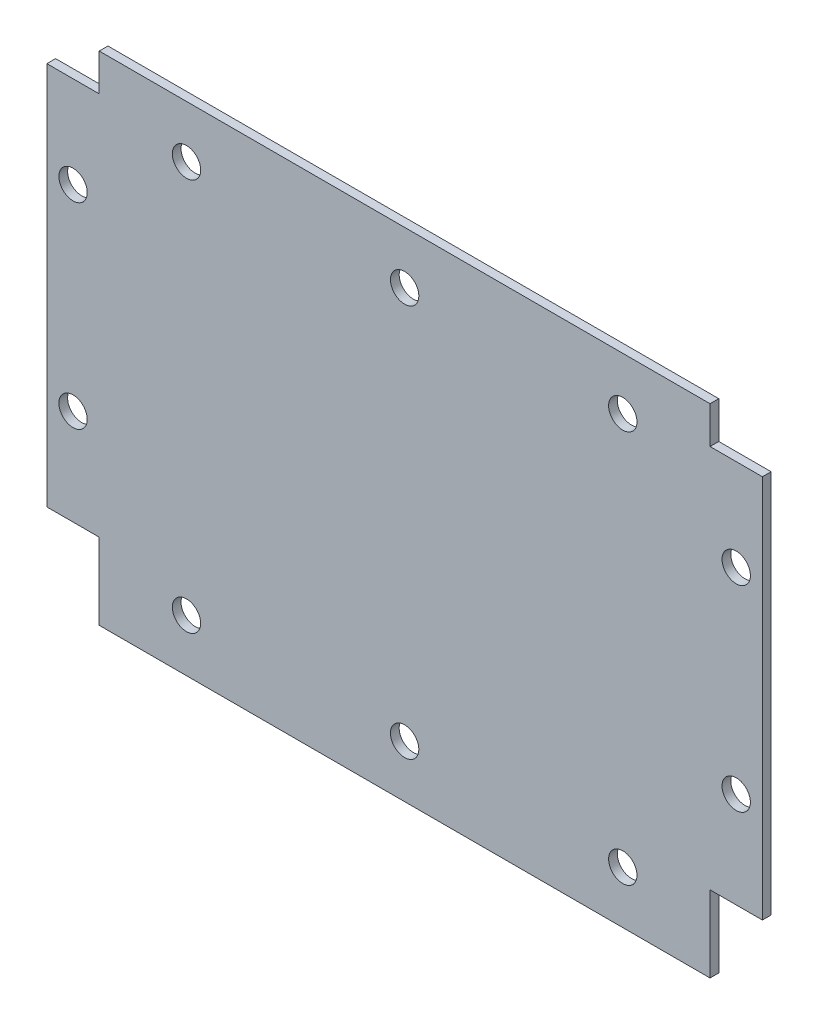
ISO-10303-21;
HEADER;
FILE_DESCRIPTION(('STEP AP214'),'2;1');
FILE_NAME('part.step','',(''),(''),'','','');
FILE_SCHEMA(('AUTOMOTIVE_DESIGN { 1 0 10303 214 1 1 1 1 }'));
ENDSEC;
DATA;
#1=APPLICATION_CONTEXT('core data for automotive mechanical design processes');
#2=APPLICATION_PROTOCOL_DEFINITION('international standard','automotive_design',2000,#1);
#3=PRODUCT_CONTEXT('',#1,'mechanical');
#4=PRODUCT('Part','Part','',(#3));
#5=PRODUCT_RELATED_PRODUCT_CATEGORY('part','',(#4));
#6=PRODUCT_DEFINITION_FORMATION('','',#4);
#7=PRODUCT_DEFINITION_CONTEXT('part definition',#1,'design');
#8=PRODUCT_DEFINITION('design','',#6,#7);
#9=PRODUCT_DEFINITION_SHAPE('','',#8);
#10=(LENGTH_UNIT() NAMED_UNIT(*) SI_UNIT(.MILLI.,.METRE.));
#11=(NAMED_UNIT(*) PLANE_ANGLE_UNIT() SI_UNIT($,.RADIAN.));
#12=(NAMED_UNIT(*) SI_UNIT($,.STERADIAN.) SOLID_ANGLE_UNIT());
#13=UNCERTAINTY_MEASURE_WITH_UNIT(LENGTH_MEASURE(1.E-05),#10,'distance_accuracy_value','');
#14=(GEOMETRIC_REPRESENTATION_CONTEXT(3) GLOBAL_UNCERTAINTY_ASSIGNED_CONTEXT((#13)) GLOBAL_UNIT_ASSIGNED_CONTEXT((#10,
#11,#12)) REPRESENTATION_CONTEXT('',''));
#15=CARTESIAN_POINT('',(0.,0.,0.));
#16=DIRECTION('',(0.,0.,1.));
#17=DIRECTION('',(1.,0.,0.));
#18=AXIS2_PLACEMENT_3D('',#15,#16,#17);
#19=CARTESIAN_POINT('',(70.,57.,2.));
#20=DIRECTION('',(0.,0.,-1.));
#21=DIRECTION('',(-1.,0.,0.));
#22=AXIS2_PLACEMENT_3D('',#19,#20,#21);
#23=PLANE('',#22);
#24=CARTESIAN_POINT('',(-76.,27.5,2.));
#25=DIRECTION('',(0.,0.,1.));
#26=DIRECTION('',(1.,0.,0.));
#27=AXIS2_PLACEMENT_3D('',#24,#25,#26);
#28=CIRCLE('',#27,3.24999999999999);
#29=CARTESIAN_POINT('',(-72.75,27.5,2.));
#30=VERTEX_POINT('',#29);
#31=EDGE_CURVE('E308',#30,#30,#28,.T.);
#32=ORIENTED_EDGE('',*,*,#31,.F.);
#33=EDGE_LOOP('',(#32));
#34=FACE_BOUND('',#33,.T.);
#35=CARTESIAN_POINT('',(-76.,-17.5,2.));
#36=DIRECTION('',(0.,0.,1.));
#37=DIRECTION('',(1.,0.,0.));
#38=AXIS2_PLACEMENT_3D('',#35,#36,#37);
#39=CIRCLE('',#38,3.24999999999999);
#40=CARTESIAN_POINT('',(-72.75,-17.5,2.));
#41=VERTEX_POINT('',#40);
#42=EDGE_CURVE('E310',#41,#41,#39,.T.);
#43=ORIENTED_EDGE('',*,*,#42,.F.);
#44=EDGE_LOOP('',(#43));
#45=FACE_BOUND('',#44,.T.);
#46=CARTESIAN_POINT('',(-50.,-45.,2.));
#47=DIRECTION('',(0.,0.,1.));
#48=DIRECTION('',(1.,0.,0.));
#49=AXIS2_PLACEMENT_3D('',#46,#47,#48);
#50=CIRCLE('',#49,3.24999999999999);
#51=CARTESIAN_POINT('',(-46.75,-45.,2.));
#52=VERTEX_POINT('',#51);
#53=EDGE_CURVE('E318',#52,#52,#50,.T.);
#54=ORIENTED_EDGE('',*,*,#53,.F.);
#55=EDGE_LOOP('',(#54));
#56=FACE_BOUND('',#55,.T.);
#57=CARTESIAN_POINT('',(0.,-45.,2.));
#58=DIRECTION('',(0.,0.,1.));
#59=DIRECTION('',(1.,0.,0.));
#60=AXIS2_PLACEMENT_3D('',#57,#58,#59);
#61=CIRCLE('',#60,3.24999999999999);
#62=CARTESIAN_POINT('',(3.24999999999999,-45.,2.));
#63=VERTEX_POINT('',#62);
#64=EDGE_CURVE('E324',#63,#63,#61,.T.);
#65=ORIENTED_EDGE('',*,*,#64,.F.);
#66=EDGE_LOOP('',(#65));
#67=FACE_BOUND('',#66,.T.);
#68=CARTESIAN_POINT('',(50.,-45.,2.));
#69=DIRECTION('',(0.,0.,1.));
#70=DIRECTION('',(1.,0.,0.));
#71=AXIS2_PLACEMENT_3D('',#68,#69,#70);
#72=CIRCLE('',#71,3.24999999999999);
#73=CARTESIAN_POINT('',(53.25,-45.,2.));
#74=VERTEX_POINT('',#73);
#75=EDGE_CURVE('E330',#74,#74,#72,.T.);
#76=ORIENTED_EDGE('',*,*,#75,.F.);
#77=EDGE_LOOP('',(#76));
#78=FACE_BOUND('',#77,.T.);
#79=CARTESIAN_POINT('',(50.,45.,2.));
#80=DIRECTION('',(0.,0.,1.));
#81=DIRECTION('',(1.,0.,0.));
#82=AXIS2_PLACEMENT_3D('',#79,#80,#81);
#83=CIRCLE('',#82,3.24999999999999);
#84=CARTESIAN_POINT('',(53.25,45.,2.));
#85=VERTEX_POINT('',#84);
#86=EDGE_CURVE('E336',#85,#85,#83,.T.);
#87=ORIENTED_EDGE('',*,*,#86,.F.);
#88=EDGE_LOOP('',(#87));
#89=FACE_BOUND('',#88,.T.);
#90=DIRECTION('',(0.,1.,0.));
#91=VECTOR('',#90,1.);
#92=CARTESIAN_POINT('',(70.,48.5,2.));
#93=LINE('',#92,#91);
#94=CARTESIAN_POINT('',(70.,48.5,2.));
#95=VERTEX_POINT('',#94);
#96=CARTESIAN_POINT('',(70.,57.,2.));
#97=VERTEX_POINT('',#96);
#98=EDGE_CURVE('E176',#95,#97,#93,.T.);
#99=ORIENTED_EDGE('',*,*,#98,.T.);
#100=DIRECTION('',(-1.,0.,0.));
#101=VECTOR('',#100,1.);
#102=CARTESIAN_POINT('',(-70.,57.,2.));
#103=LINE('',#102,#101);
#104=CARTESIAN_POINT('',(-70.,57.,2.));
#105=VERTEX_POINT('',#104);
#106=EDGE_CURVE('E104',#97,#105,#103,.T.);
#107=ORIENTED_EDGE('',*,*,#106,.T.);
#108=DIRECTION('',(0.,-1.,0.));
#109=VECTOR('',#108,1.);
#110=CARTESIAN_POINT('',(-70.,48.5,2.));
#111=LINE('',#110,#109);
#112=CARTESIAN_POINT('',(-70.,48.5,2.));
#113=VERTEX_POINT('',#112);
#114=EDGE_CURVE('E203',#105,#113,#111,.T.);
#115=ORIENTED_EDGE('',*,*,#114,.T.);
#116=DIRECTION('',(-1.,0.,0.));
#117=VECTOR('',#116,1.);
#118=CARTESIAN_POINT('',(-82.,48.5,2.));
#119=LINE('',#118,#117);
#120=CARTESIAN_POINT('',(-82.,48.5,2.));
#121=VERTEX_POINT('',#120);
#122=EDGE_CURVE('E222',#113,#121,#119,.T.);
#123=ORIENTED_EDGE('',*,*,#122,.T.);
#124=DIRECTION('',(0.,-1.,0.));
#125=VECTOR('',#124,1.);
#126=CARTESIAN_POINT('',(-82.,48.5,2.));
#127=LINE('',#126,#125);
#128=CARTESIAN_POINT('',(-82.,-39.5,2.));
#129=VERTEX_POINT('',#128);
#130=EDGE_CURVE('E219',#121,#129,#127,.T.);
#131=ORIENTED_EDGE('',*,*,#130,.T.);
#132=DIRECTION('',(1.,0.,0.));
#133=VECTOR('',#132,1.);
#134=CARTESIAN_POINT('',(-82.,-39.5,2.));
#135=LINE('',#134,#133);
#136=CARTESIAN_POINT('',(-70.,-39.5,2.));
#137=VERTEX_POINT('',#136);
#138=EDGE_CURVE('E221',#129,#137,#135,.T.);
#139=ORIENTED_EDGE('',*,*,#138,.T.);
#140=DIRECTION('',(0.,-1.,0.));
#141=VECTOR('',#140,1.);
#142=CARTESIAN_POINT('',(-70.,-57.,2.));
#143=LINE('',#142,#141);
#144=CARTESIAN_POINT('',(-70.,-57.,2.));
#145=VERTEX_POINT('',#144);
#146=EDGE_CURVE('E224',#137,#145,#143,.T.);
#147=ORIENTED_EDGE('',*,*,#146,.T.);
#148=DIRECTION('',(1.,0.,0.));
#149=VECTOR('',#148,1.);
#150=CARTESIAN_POINT('',(-70.,-57.,2.));
#151=LINE('',#150,#149);
#152=CARTESIAN_POINT('',(70.,-57.,2.));
#153=VERTEX_POINT('',#152);
#154=EDGE_CURVE('E230',#145,#153,#151,.T.);
#155=ORIENTED_EDGE('',*,*,#154,.T.);
#156=DIRECTION('',(0.,1.,0.));
#157=VECTOR('',#156,1.);
#158=CARTESIAN_POINT('',(70.,-57.,2.));
#159=LINE('',#158,#157);
#160=CARTESIAN_POINT('',(70.,-39.5,2.));
#161=VERTEX_POINT('',#160);
#162=EDGE_CURVE('E135',#153,#161,#159,.T.);
#163=ORIENTED_EDGE('',*,*,#162,.T.);
#164=DIRECTION('',(1.,0.,0.));
#165=VECTOR('',#164,1.);
#166=CARTESIAN_POINT('',(70.,-39.5,2.));
#167=LINE('',#166,#165);
#168=CARTESIAN_POINT('',(82.,-39.5,2.));
#169=VERTEX_POINT('',#168);
#170=EDGE_CURVE('E129',#161,#169,#167,.T.);
#171=ORIENTED_EDGE('',*,*,#170,.T.);
#172=DIRECTION('',(0.,1.,0.));
#173=VECTOR('',#172,1.);
#174=CARTESIAN_POINT('',(82.,48.5,2.));
#175=LINE('',#174,#173);
#176=CARTESIAN_POINT('',(82.,48.5,2.));
#177=VERTEX_POINT('',#176);
#178=EDGE_CURVE('E133',#169,#177,#175,.T.);
#179=ORIENTED_EDGE('',*,*,#178,.T.);
#180=DIRECTION('',(-1.,0.,0.));
#181=VECTOR('',#180,1.);
#182=CARTESIAN_POINT('',(70.,48.5,2.));
#183=LINE('',#182,#181);
#184=EDGE_CURVE('E49',#177,#95,#183,.T.);
#185=ORIENTED_EDGE('',*,*,#184,.T.);
#186=EDGE_LOOP('',(#99,#107,#115,#123,#131,#139,#147,#155,#163,#171,#179,#185));
#187=FACE_BOUND('',#186,.T.);
#188=CARTESIAN_POINT('',(76.,-17.5,2.));
#189=DIRECTION('',(0.,0.,1.));
#190=DIRECTION('',(1.,0.,0.));
#191=AXIS2_PLACEMENT_3D('',#188,#189,#190);
#192=CIRCLE('',#191,3.24999999999999);
#193=CARTESIAN_POINT('',(79.25,-17.5,2.));
#194=VERTEX_POINT('',#193);
#195=EDGE_CURVE('E360',#194,#194,#192,.T.);
#196=ORIENTED_EDGE('',*,*,#195,.F.);
#197=EDGE_LOOP('',(#196));
#198=FACE_BOUND('',#197,.T.);
#199=CARTESIAN_POINT('',(76.,27.5,2.));
#200=DIRECTION('',(0.,0.,1.));
#201=DIRECTION('',(1.,0.,0.));
#202=AXIS2_PLACEMENT_3D('',#199,#200,#201);
#203=CIRCLE('',#202,3.24999999999999);
#204=CARTESIAN_POINT('',(79.25,27.5,2.));
#205=VERTEX_POINT('',#204);
#206=EDGE_CURVE('E354',#205,#205,#203,.T.);
#207=ORIENTED_EDGE('',*,*,#206,.F.);
#208=EDGE_LOOP('',(#207));
#209=FACE_BOUND('',#208,.T.);
#210=CARTESIAN_POINT('',(-50.,45.,2.));
#211=DIRECTION('',(0.,0.,1.));
#212=DIRECTION('',(1.,0.,0.));
#213=AXIS2_PLACEMENT_3D('',#210,#211,#212);
#214=CIRCLE('',#213,3.24999999999999);
#215=CARTESIAN_POINT('',(-46.75,45.,2.));
#216=VERTEX_POINT('',#215);
#217=EDGE_CURVE('E348',#216,#216,#214,.T.);
#218=ORIENTED_EDGE('',*,*,#217,.F.);
#219=EDGE_LOOP('',(#218));
#220=FACE_BOUND('',#219,.T.);
#221=CARTESIAN_POINT('',(0.,45.,2.));
#222=DIRECTION('',(0.,0.,1.));
#223=DIRECTION('',(1.,0.,0.));
#224=AXIS2_PLACEMENT_3D('',#221,#222,#223);
#225=CIRCLE('',#224,3.24999999999999);
#226=CARTESIAN_POINT('',(3.24999999999999,45.,2.));
#227=VERTEX_POINT('',#226);
#228=EDGE_CURVE('E342',#227,#227,#225,.T.);
#229=ORIENTED_EDGE('',*,*,#228,.F.);
#230=EDGE_LOOP('',(#229));
#231=FACE_BOUND('',#230,.T.);
#232=ADVANCED_FACE('F32',(#34,#45,#56,#67,#78,#89,#187,#198,#209,#220,#231),#23,.F.);
#233=CARTESIAN_POINT('',(70.,57.,0.));
#234=DIRECTION('',(0.,0.,-1.));
#235=DIRECTION('',(-1.,0.,0.));
#236=AXIS2_PLACEMENT_3D('',#233,#234,#235);
#237=PLANE('',#236);
#238=CARTESIAN_POINT('',(-76.,27.5,0.));
#239=DIRECTION('',(0.,0.,1.));
#240=DIRECTION('',(1.,0.,0.));
#241=AXIS2_PLACEMENT_3D('',#238,#239,#240);
#242=CIRCLE('',#241,3.25);
#243=CARTESIAN_POINT('',(-72.75,27.5,0.));
#244=VERTEX_POINT('',#243);
#245=EDGE_CURVE('E306',#244,#244,#242,.T.);
#246=ORIENTED_EDGE('',*,*,#245,.T.);
#247=EDGE_LOOP('',(#246));
#248=FACE_BOUND('',#247,.T.);
#249=CARTESIAN_POINT('',(-76.,-17.5,0.));
#250=DIRECTION('',(0.,0.,1.));
#251=DIRECTION('',(1.,0.,0.));
#252=AXIS2_PLACEMENT_3D('',#249,#250,#251);
#253=CIRCLE('',#252,3.25);
#254=CARTESIAN_POINT('',(-72.75,-17.5,0.));
#255=VERTEX_POINT('',#254);
#256=EDGE_CURVE('E315',#255,#255,#253,.T.);
#257=ORIENTED_EDGE('',*,*,#256,.T.);
#258=EDGE_LOOP('',(#257));
#259=FACE_BOUND('',#258,.T.);
#260=CARTESIAN_POINT('',(-50.,-45.,0.));
#261=DIRECTION('',(0.,0.,1.));
#262=DIRECTION('',(1.,0.,0.));
#263=AXIS2_PLACEMENT_3D('',#260,#261,#262);
#264=CIRCLE('',#263,3.25);
#265=CARTESIAN_POINT('',(-46.75,-45.,0.));
#266=VERTEX_POINT('',#265);
#267=EDGE_CURVE('E321',#266,#266,#264,.T.);
#268=ORIENTED_EDGE('',*,*,#267,.T.);
#269=EDGE_LOOP('',(#268));
#270=FACE_BOUND('',#269,.T.);
#271=CARTESIAN_POINT('',(0.,-45.,0.));
#272=DIRECTION('',(0.,0.,1.));
#273=DIRECTION('',(1.,0.,0.));
#274=AXIS2_PLACEMENT_3D('',#271,#272,#273);
#275=CIRCLE('',#274,3.25);
#276=CARTESIAN_POINT('',(3.25,-45.,0.));
#277=VERTEX_POINT('',#276);
#278=EDGE_CURVE('E327',#277,#277,#275,.T.);
#279=ORIENTED_EDGE('',*,*,#278,.T.);
#280=EDGE_LOOP('',(#279));
#281=FACE_BOUND('',#280,.T.);
#282=CARTESIAN_POINT('',(50.,-45.,0.));
#283=DIRECTION('',(0.,0.,1.));
#284=DIRECTION('',(1.,0.,0.));
#285=AXIS2_PLACEMENT_3D('',#282,#283,#284);
#286=CIRCLE('',#285,3.25);
#287=CARTESIAN_POINT('',(53.25,-45.,0.));
#288=VERTEX_POINT('',#287);
#289=EDGE_CURVE('E333',#288,#288,#286,.T.);
#290=ORIENTED_EDGE('',*,*,#289,.T.);
#291=EDGE_LOOP('',(#290));
#292=FACE_BOUND('',#291,.T.);
#293=CARTESIAN_POINT('',(50.,45.,0.));
#294=DIRECTION('',(0.,0.,1.));
#295=DIRECTION('',(1.,0.,0.));
#296=AXIS2_PLACEMENT_3D('',#293,#294,#295);
#297=CIRCLE('',#296,3.25);
#298=CARTESIAN_POINT('',(53.25,45.,0.));
#299=VERTEX_POINT('',#298);
#300=EDGE_CURVE('E339',#299,#299,#297,.T.);
#301=ORIENTED_EDGE('',*,*,#300,.T.);
#302=EDGE_LOOP('',(#301));
#303=FACE_BOUND('',#302,.T.);
#304=CARTESIAN_POINT('',(0.,45.,0.));
#305=DIRECTION('',(0.,0.,1.));
#306=DIRECTION('',(1.,0.,0.));
#307=AXIS2_PLACEMENT_3D('',#304,#305,#306);
#308=CIRCLE('',#307,3.25);
#309=CARTESIAN_POINT('',(3.25,45.,0.));
#310=VERTEX_POINT('',#309);
#311=EDGE_CURVE('E345',#310,#310,#308,.T.);
#312=ORIENTED_EDGE('',*,*,#311,.T.);
#313=EDGE_LOOP('',(#312));
#314=FACE_BOUND('',#313,.T.);
#315=CARTESIAN_POINT('',(-50.,45.,0.));
#316=DIRECTION('',(0.,0.,1.));
#317=DIRECTION('',(1.,0.,0.));
#318=AXIS2_PLACEMENT_3D('',#315,#316,#317);
#319=CIRCLE('',#318,3.25);
#320=CARTESIAN_POINT('',(-46.75,45.,0.));
#321=VERTEX_POINT('',#320);
#322=EDGE_CURVE('E351',#321,#321,#319,.T.);
#323=ORIENTED_EDGE('',*,*,#322,.T.);
#324=EDGE_LOOP('',(#323));
#325=FACE_BOUND('',#324,.T.);
#326=CARTESIAN_POINT('',(76.,27.5,0.));
#327=DIRECTION('',(0.,0.,1.));
#328=DIRECTION('',(1.,0.,0.));
#329=AXIS2_PLACEMENT_3D('',#326,#327,#328);
#330=CIRCLE('',#329,3.25);
#331=CARTESIAN_POINT('',(79.25,27.5,0.));
#332=VERTEX_POINT('',#331);
#333=EDGE_CURVE('E357',#332,#332,#330,.T.);
#334=ORIENTED_EDGE('',*,*,#333,.T.);
#335=EDGE_LOOP('',(#334));
#336=FACE_BOUND('',#335,.T.);
#337=DIRECTION('',(0.,1.,0.));
#338=VECTOR('',#337,1.);
#339=CARTESIAN_POINT('',(70.,48.5,0.));
#340=LINE('',#339,#338);
#341=CARTESIAN_POINT('',(70.,48.5,0.));
#342=VERTEX_POINT('',#341);
#343=CARTESIAN_POINT('',(70.,57.,0.));
#344=VERTEX_POINT('',#343);
#345=EDGE_CURVE('E153',#342,#344,#340,.T.);
#346=ORIENTED_EDGE('',*,*,#345,.F.);
#347=DIRECTION('',(-1.,0.,0.));
#348=VECTOR('',#347,1.);
#349=CARTESIAN_POINT('',(70.,48.5,0.));
#350=LINE('',#349,#348);
#351=CARTESIAN_POINT('',(82.,48.5,0.));
#352=VERTEX_POINT('',#351);
#353=EDGE_CURVE('E96',#352,#342,#350,.T.);
#354=ORIENTED_EDGE('',*,*,#353,.F.);
#355=DIRECTION('',(0.,1.,0.));
#356=VECTOR('',#355,1.);
#357=CARTESIAN_POINT('',(82.,48.5,0.));
#358=LINE('',#357,#356);
#359=CARTESIAN_POINT('',(82.,-39.5,0.));
#360=VERTEX_POINT('',#359);
#361=EDGE_CURVE('E90',#360,#352,#358,.T.);
#362=ORIENTED_EDGE('',*,*,#361,.F.);
#363=DIRECTION('',(1.,0.,0.));
#364=VECTOR('',#363,1.);
#365=CARTESIAN_POINT('',(70.,-39.5,0.));
#366=LINE('',#365,#364);
#367=CARTESIAN_POINT('',(70.,-39.5,0.));
#368=VERTEX_POINT('',#367);
#369=EDGE_CURVE('E143',#368,#360,#366,.T.);
#370=ORIENTED_EDGE('',*,*,#369,.F.);
#371=DIRECTION('',(0.,1.,0.));
#372=VECTOR('',#371,1.);
#373=CARTESIAN_POINT('',(70.,-57.,0.));
#374=LINE('',#373,#372);
#375=CARTESIAN_POINT('',(70.,-57.,0.));
#376=VERTEX_POINT('',#375);
#377=EDGE_CURVE('E171',#376,#368,#374,.T.);
#378=ORIENTED_EDGE('',*,*,#377,.F.);
#379=DIRECTION('',(1.,0.,0.));
#380=VECTOR('',#379,1.);
#381=CARTESIAN_POINT('',(-70.,-57.,0.));
#382=LINE('',#381,#380);
#383=CARTESIAN_POINT('',(-70.,-57.,0.));
#384=VERTEX_POINT('',#383);
#385=EDGE_CURVE('E169',#384,#376,#382,.T.);
#386=ORIENTED_EDGE('',*,*,#385,.F.);
#387=DIRECTION('',(0.,-1.,0.));
#388=VECTOR('',#387,1.);
#389=CARTESIAN_POINT('',(-70.,-57.,0.));
#390=LINE('',#389,#388);
#391=CARTESIAN_POINT('',(-70.,-39.5,0.));
#392=VERTEX_POINT('',#391);
#393=EDGE_CURVE('E167',#392,#384,#390,.T.);
#394=ORIENTED_EDGE('',*,*,#393,.F.);
#395=DIRECTION('',(1.,0.,0.));
#396=VECTOR('',#395,1.);
#397=CARTESIAN_POINT('',(-82.,-39.5,0.));
#398=LINE('',#397,#396);
#399=CARTESIAN_POINT('',(-82.,-39.5,0.));
#400=VERTEX_POINT('',#399);
#401=EDGE_CURVE('E165',#400,#392,#398,.T.);
#402=ORIENTED_EDGE('',*,*,#401,.F.);
#403=DIRECTION('',(0.,-1.,0.));
#404=VECTOR('',#403,1.);
#405=CARTESIAN_POINT('',(-82.,48.5,0.));
#406=LINE('',#405,#404);
#407=CARTESIAN_POINT('',(-82.,48.5,0.));
#408=VERTEX_POINT('',#407);
#409=EDGE_CURVE('E163',#408,#400,#406,.T.);
#410=ORIENTED_EDGE('',*,*,#409,.F.);
#411=DIRECTION('',(-1.,0.,0.));
#412=VECTOR('',#411,1.);
#413=CARTESIAN_POINT('',(-82.,48.5,0.));
#414=LINE('',#413,#412);
#415=CARTESIAN_POINT('',(-70.,48.5,0.));
#416=VERTEX_POINT('',#415);
#417=EDGE_CURVE('E161',#416,#408,#414,.T.);
#418=ORIENTED_EDGE('',*,*,#417,.F.);
#419=DIRECTION('',(0.,-1.,0.));
#420=VECTOR('',#419,1.);
#421=CARTESIAN_POINT('',(-70.,48.5,0.));
#422=LINE('',#421,#420);
#423=CARTESIAN_POINT('',(-70.,57.,0.));
#424=VERTEX_POINT('',#423);
#425=EDGE_CURVE('E159',#424,#416,#422,.T.);
#426=ORIENTED_EDGE('',*,*,#425,.F.);
#427=DIRECTION('',(-1.,0.,0.));
#428=VECTOR('',#427,1.);
#429=CARTESIAN_POINT('',(-70.,57.,0.));
#430=LINE('',#429,#428);
#431=EDGE_CURVE('E156',#344,#424,#430,.T.);
#432=ORIENTED_EDGE('',*,*,#431,.F.);
#433=EDGE_LOOP('',(#346,#354,#362,#370,#378,#386,#394,#402,#410,#418,#426,#432));
#434=FACE_BOUND('',#433,.T.);
#435=CARTESIAN_POINT('',(76.,-17.5,0.));
#436=DIRECTION('',(0.,0.,1.));
#437=DIRECTION('',(1.,0.,0.));
#438=AXIS2_PLACEMENT_3D('',#435,#436,#437);
#439=CIRCLE('',#438,3.25);
#440=CARTESIAN_POINT('',(79.25,-17.5,0.));
#441=VERTEX_POINT('',#440);
#442=EDGE_CURVE('E157',#441,#441,#439,.T.);
#443=ORIENTED_EDGE('',*,*,#442,.T.);
#444=EDGE_LOOP('',(#443));
#445=FACE_BOUND('',#444,.T.);
#446=ADVANCED_FACE('F207',(#248,#259,#270,#281,#292,#303,#314,#325,#336,#434,#445),#237,.T.);
#447=CARTESIAN_POINT('',(70.,48.5,2.));
#448=DIRECTION('',(-1.,0.,0.));
#449=DIRECTION('',(0.,0.,1.));
#450=AXIS2_PLACEMENT_3D('',#447,#448,#449);
#451=PLANE('',#450);
#452=ORIENTED_EDGE('',*,*,#345,.T.);
#453=DIRECTION('',(0.,0.,-1.));
#454=VECTOR('',#453,1.);
#455=CARTESIAN_POINT('',(70.,57.,2.));
#456=LINE('',#455,#454);
#457=EDGE_CURVE('E11',#97,#344,#456,.T.);
#458=ORIENTED_EDGE('',*,*,#457,.F.);
#459=ORIENTED_EDGE('',*,*,#98,.F.);
#460=DIRECTION('',(0.,0.,-1.));
#461=VECTOR('',#460,1.);
#462=CARTESIAN_POINT('',(70.,48.5,2.));
#463=LINE('',#462,#461);
#464=EDGE_CURVE('E149',#95,#342,#463,.T.);
#465=ORIENTED_EDGE('',*,*,#464,.T.);
#466=EDGE_LOOP('',(#452,#458,#459,#465));
#467=FACE_BOUND('',#466,.T.);
#468=ADVANCED_FACE('F34',(#467),#451,.F.);
#469=CARTESIAN_POINT('',(-70.,57.,2.));
#470=DIRECTION('',(0.,-1.,0.));
#471=DIRECTION('',(0.,0.,-1.));
#472=AXIS2_PLACEMENT_3D('',#469,#470,#471);
#473=PLANE('',#472);
#474=ORIENTED_EDGE('',*,*,#431,.T.);
#475=DIRECTION('',(0.,0.,-1.));
#476=VECTOR('',#475,1.);
#477=CARTESIAN_POINT('',(-70.,57.,2.));
#478=LINE('',#477,#476);
#479=EDGE_CURVE('E41',#105,#424,#478,.T.);
#480=ORIENTED_EDGE('',*,*,#479,.F.);
#481=ORIENTED_EDGE('',*,*,#106,.F.);
#482=ORIENTED_EDGE('',*,*,#457,.T.);
#483=EDGE_LOOP('',(#474,#480,#481,#482));
#484=FACE_BOUND('',#483,.T.);
#485=ADVANCED_FACE('F534',(#484),#473,.F.);
#486=CARTESIAN_POINT('',(-70.,48.5,2.));
#487=DIRECTION('',(1.,0.,0.));
#488=DIRECTION('',(0.,0.,-1.));
#489=AXIS2_PLACEMENT_3D('',#486,#487,#488);
#490=PLANE('',#489);
#491=ORIENTED_EDGE('',*,*,#425,.T.);
#492=DIRECTION('',(0.,0.,-1.));
#493=VECTOR('',#492,1.);
#494=CARTESIAN_POINT('',(-70.,48.5,2.));
#495=LINE('',#494,#493);
#496=EDGE_CURVE('E195',#113,#416,#495,.T.);
#497=ORIENTED_EDGE('',*,*,#496,.F.);
#498=ORIENTED_EDGE('',*,*,#114,.F.);
#499=ORIENTED_EDGE('',*,*,#479,.T.);
#500=EDGE_LOOP('',(#491,#497,#498,#499));
#501=FACE_BOUND('',#500,.T.);
#502=ADVANCED_FACE('F201',(#501),#490,.F.);
#503=CARTESIAN_POINT('',(-82.,48.5,2.));
#504=DIRECTION('',(0.,-1.,0.));
#505=DIRECTION('',(0.,0.,-1.));
#506=AXIS2_PLACEMENT_3D('',#503,#504,#505);
#507=PLANE('',#506);
#508=ORIENTED_EDGE('',*,*,#417,.T.);
#509=DIRECTION('',(0.,0.,-1.));
#510=VECTOR('',#509,1.);
#511=CARTESIAN_POINT('',(-82.,48.5,2.));
#512=LINE('',#511,#510);
#513=EDGE_CURVE('E192',#121,#408,#512,.T.);
#514=ORIENTED_EDGE('',*,*,#513,.F.);
#515=ORIENTED_EDGE('',*,*,#122,.F.);
#516=ORIENTED_EDGE('',*,*,#496,.T.);
#517=EDGE_LOOP('',(#508,#514,#515,#516));
#518=FACE_BOUND('',#517,.T.);
#519=ADVANCED_FACE('F213',(#518),#507,.F.);
#520=CARTESIAN_POINT('',(-82.,48.5,2.));
#521=DIRECTION('',(1.,0.,0.));
#522=DIRECTION('',(0.,1.,0.));
#523=AXIS2_PLACEMENT_3D('',#520,#521,#522);
#524=PLANE('',#523);
#525=ORIENTED_EDGE('',*,*,#409,.T.);
#526=DIRECTION('',(0.,0.,-1.));
#527=VECTOR('',#526,1.);
#528=CARTESIAN_POINT('',(-82.,-39.5,2.));
#529=LINE('',#528,#527);
#530=EDGE_CURVE('E189',#129,#400,#529,.T.);
#531=ORIENTED_EDGE('',*,*,#530,.F.);
#532=ORIENTED_EDGE('',*,*,#130,.F.);
#533=ORIENTED_EDGE('',*,*,#513,.T.);
#534=EDGE_LOOP('',(#525,#531,#532,#533));
#535=FACE_BOUND('',#534,.T.);
#536=ADVANCED_FACE('F217',(#535),#524,.F.);
#537=CARTESIAN_POINT('',(-82.,-39.5,2.));
#538=DIRECTION('',(0.,1.,0.));
#539=DIRECTION('',(0.,0.,1.));
#540=AXIS2_PLACEMENT_3D('',#537,#538,#539);
#541=PLANE('',#540);
#542=ORIENTED_EDGE('',*,*,#401,.T.);
#543=DIRECTION('',(0.,0.,-1.));
#544=VECTOR('',#543,1.);
#545=CARTESIAN_POINT('',(-70.,-39.5,2.));
#546=LINE('',#545,#544);
#547=EDGE_CURVE('E186',#137,#392,#546,.T.);
#548=ORIENTED_EDGE('',*,*,#547,.F.);
#549=ORIENTED_EDGE('',*,*,#138,.F.);
#550=ORIENTED_EDGE('',*,*,#530,.T.);
#551=EDGE_LOOP('',(#542,#548,#549,#550));
#552=FACE_BOUND('',#551,.T.);
#553=ADVANCED_FACE('F499',(#552),#541,.F.);
#554=CARTESIAN_POINT('',(-70.,-57.,2.));
#555=DIRECTION('',(1.,0.,0.));
#556=DIRECTION('',(0.,0.,-1.));
#557=AXIS2_PLACEMENT_3D('',#554,#555,#556);
#558=PLANE('',#557);
#559=ORIENTED_EDGE('',*,*,#393,.T.);
#560=DIRECTION('',(0.,0.,-1.));
#561=VECTOR('',#560,1.);
#562=CARTESIAN_POINT('',(-70.,-57.,2.));
#563=LINE('',#562,#561);
#564=EDGE_CURVE('E183',#145,#384,#563,.T.);
#565=ORIENTED_EDGE('',*,*,#564,.F.);
#566=ORIENTED_EDGE('',*,*,#146,.F.);
#567=ORIENTED_EDGE('',*,*,#547,.T.);
#568=EDGE_LOOP('',(#559,#565,#566,#567));
#569=FACE_BOUND('',#568,.T.);
#570=ADVANCED_FACE('F490',(#569),#558,.F.);
#571=CARTESIAN_POINT('',(-70.,-57.,2.));
#572=DIRECTION('',(0.,1.,0.));
#573=DIRECTION('',(-1.,0.,0.));
#574=AXIS2_PLACEMENT_3D('',#571,#572,#573);
#575=PLANE('',#574);
#576=ORIENTED_EDGE('',*,*,#385,.T.);
#577=DIRECTION('',(0.,0.,-1.));
#578=VECTOR('',#577,1.);
#579=CARTESIAN_POINT('',(70.,-57.,2.));
#580=LINE('',#579,#578);
#581=EDGE_CURVE('E180',#153,#376,#580,.T.);
#582=ORIENTED_EDGE('',*,*,#581,.F.);
#583=ORIENTED_EDGE('',*,*,#154,.F.);
#584=ORIENTED_EDGE('',*,*,#564,.T.);
#585=EDGE_LOOP('',(#576,#582,#583,#584));
#586=FACE_BOUND('',#585,.T.);
#587=ADVANCED_FACE('F236',(#586),#575,.F.);
#588=CARTESIAN_POINT('',(70.,-57.,2.));
#589=DIRECTION('',(-1.,0.,0.));
#590=DIRECTION('',(0.,0.,1.));
#591=AXIS2_PLACEMENT_3D('',#588,#589,#590);
#592=PLANE('',#591);
#593=ORIENTED_EDGE('',*,*,#377,.T.);
#594=DIRECTION('',(0.,0.,-1.));
#595=VECTOR('',#594,1.);
#596=CARTESIAN_POINT('',(70.,-39.5,2.));
#597=LINE('',#596,#595);
#598=EDGE_CURVE('E144',#161,#368,#597,.T.);
#599=ORIENTED_EDGE('',*,*,#598,.F.);
#600=ORIENTED_EDGE('',*,*,#162,.F.);
#601=ORIENTED_EDGE('',*,*,#581,.T.);
#602=EDGE_LOOP('',(#593,#599,#600,#601));
#603=FACE_BOUND('',#602,.T.);
#604=ADVANCED_FACE('F240',(#603),#592,.F.);
#605=CARTESIAN_POINT('',(70.,-39.5,2.));
#606=DIRECTION('',(0.,1.,0.));
#607=DIRECTION('',(-1.,0.,0.));
#608=AXIS2_PLACEMENT_3D('',#605,#606,#607);
#609=PLANE('',#608);
#610=ORIENTED_EDGE('',*,*,#369,.T.);
#611=DIRECTION('',(0.,0.,-1.));
#612=VECTOR('',#611,1.);
#613=CARTESIAN_POINT('',(82.,-39.5,2.));
#614=LINE('',#613,#612);
#615=EDGE_CURVE('E140',#169,#360,#614,.T.);
#616=ORIENTED_EDGE('',*,*,#615,.F.);
#617=ORIENTED_EDGE('',*,*,#170,.F.);
#618=ORIENTED_EDGE('',*,*,#598,.T.);
#619=EDGE_LOOP('',(#610,#616,#617,#618));
#620=FACE_BOUND('',#619,.T.);
#621=ADVANCED_FACE('F141',(#620),#609,.F.);
#622=CARTESIAN_POINT('',(82.,48.5,2.));
#623=DIRECTION('',(-1.,0.,0.));
#624=DIRECTION('',(0.,-1.,0.));
#625=AXIS2_PLACEMENT_3D('',#622,#623,#624);
#626=PLANE('',#625);
#627=ORIENTED_EDGE('',*,*,#361,.T.);
#628=DIRECTION('',(0.,0.,-1.));
#629=VECTOR('',#628,1.);
#630=CARTESIAN_POINT('',(82.,48.5,2.));
#631=LINE('',#630,#629);
#632=EDGE_CURVE('E145',#177,#352,#631,.T.);
#633=ORIENTED_EDGE('',*,*,#632,.F.);
#634=ORIENTED_EDGE('',*,*,#178,.F.);
#635=ORIENTED_EDGE('',*,*,#615,.T.);
#636=EDGE_LOOP('',(#627,#633,#634,#635));
#637=FACE_BOUND('',#636,.T.);
#638=ADVANCED_FACE('F147',(#637),#626,.F.);
#639=CARTESIAN_POINT('',(70.,48.5,2.));
#640=DIRECTION('',(0.,-1.,0.));
#641=DIRECTION('',(1.,0.,0.));
#642=AXIS2_PLACEMENT_3D('',#639,#640,#641);
#643=PLANE('',#642);
#644=ORIENTED_EDGE('',*,*,#353,.T.);
#645=ORIENTED_EDGE('',*,*,#464,.F.);
#646=ORIENTED_EDGE('',*,*,#184,.F.);
#647=ORIENTED_EDGE('',*,*,#632,.T.);
#648=EDGE_LOOP('',(#644,#645,#646,#647));
#649=FACE_BOUND('',#648,.T.);
#650=ADVANCED_FACE('F244',(#649),#643,.F.);
#651=CARTESIAN_POINT('',(76.,-17.5,2.));
#652=DIRECTION('',(0.,0.,1.));
#653=DIRECTION('',(1.,0.,0.));
#654=AXIS2_PLACEMENT_3D('',#651,#652,#653);
#655=CYLINDRICAL_SURFACE('',#654,3.25);
#656=ORIENTED_EDGE('',*,*,#442,.F.);
#657=EDGE_LOOP('',(#656));
#658=FACE_BOUND('',#657,.T.);
#659=ORIENTED_EDGE('',*,*,#195,.T.);
#660=EDGE_LOOP('',(#659));
#661=FACE_BOUND('',#660,.T.);
#662=ADVANCED_FACE('F246',(#658,#661),#655,.F.);
#663=CARTESIAN_POINT('',(76.,27.5,2.));
#664=DIRECTION('',(0.,0.,1.));
#665=DIRECTION('',(1.,0.,0.));
#666=AXIS2_PLACEMENT_3D('',#663,#664,#665);
#667=CYLINDRICAL_SURFACE('',#666,3.25);
#668=ORIENTED_EDGE('',*,*,#333,.F.);
#669=EDGE_LOOP('',(#668));
#670=FACE_BOUND('',#669,.T.);
#671=ORIENTED_EDGE('',*,*,#206,.T.);
#672=EDGE_LOOP('',(#671));
#673=FACE_BOUND('',#672,.T.);
#674=ADVANCED_FACE('F252',(#670,#673),#667,.F.);
#675=CARTESIAN_POINT('',(-50.,45.,2.));
#676=DIRECTION('',(0.,0.,1.));
#677=DIRECTION('',(1.,0.,0.));
#678=AXIS2_PLACEMENT_3D('',#675,#676,#677);
#679=CYLINDRICAL_SURFACE('',#678,3.25);
#680=ORIENTED_EDGE('',*,*,#322,.F.);
#681=EDGE_LOOP('',(#680));
#682=FACE_BOUND('',#681,.T.);
#683=ORIENTED_EDGE('',*,*,#217,.T.);
#684=EDGE_LOOP('',(#683));
#685=FACE_BOUND('',#684,.T.);
#686=ADVANCED_FACE('F269',(#682,#685),#679,.F.);
#687=CARTESIAN_POINT('',(0.,45.,2.));
#688=DIRECTION('',(0.,0.,1.));
#689=DIRECTION('',(1.,0.,0.));
#690=AXIS2_PLACEMENT_3D('',#687,#688,#689);
#691=CYLINDRICAL_SURFACE('',#690,3.24999999999999);
#692=ORIENTED_EDGE('',*,*,#311,.F.);
#693=EDGE_LOOP('',(#692));
#694=FACE_BOUND('',#693,.T.);
#695=ORIENTED_EDGE('',*,*,#228,.T.);
#696=EDGE_LOOP('',(#695));
#697=FACE_BOUND('',#696,.T.);
#698=ADVANCED_FACE('F273',(#694,#697),#691,.F.);
#699=CARTESIAN_POINT('',(50.,45.,2.));
#700=DIRECTION('',(0.,0.,1.));
#701=DIRECTION('',(1.,0.,0.));
#702=AXIS2_PLACEMENT_3D('',#699,#700,#701);
#703=CYLINDRICAL_SURFACE('',#702,3.25);
#704=ORIENTED_EDGE('',*,*,#300,.F.);
#705=EDGE_LOOP('',(#704));
#706=FACE_BOUND('',#705,.T.);
#707=ORIENTED_EDGE('',*,*,#86,.T.);
#708=EDGE_LOOP('',(#707));
#709=FACE_BOUND('',#708,.T.);
#710=ADVANCED_FACE('F277',(#706,#709),#703,.F.);
#711=CARTESIAN_POINT('',(50.,-45.,2.));
#712=DIRECTION('',(0.,0.,1.));
#713=DIRECTION('',(1.,0.,0.));
#714=AXIS2_PLACEMENT_3D('',#711,#712,#713);
#715=CYLINDRICAL_SURFACE('',#714,3.25);
#716=ORIENTED_EDGE('',*,*,#289,.F.);
#717=EDGE_LOOP('',(#716));
#718=FACE_BOUND('',#717,.T.);
#719=ORIENTED_EDGE('',*,*,#75,.T.);
#720=EDGE_LOOP('',(#719));
#721=FACE_BOUND('',#720,.T.);
#722=ADVANCED_FACE('F281',(#718,#721),#715,.F.);
#723=CARTESIAN_POINT('',(0.,-45.,2.));
#724=DIRECTION('',(0.,0.,1.));
#725=DIRECTION('',(1.,0.,0.));
#726=AXIS2_PLACEMENT_3D('',#723,#724,#725);
#727=CYLINDRICAL_SURFACE('',#726,3.24999999999999);
#728=ORIENTED_EDGE('',*,*,#278,.F.);
#729=EDGE_LOOP('',(#728));
#730=FACE_BOUND('',#729,.T.);
#731=ORIENTED_EDGE('',*,*,#64,.T.);
#732=EDGE_LOOP('',(#731));
#733=FACE_BOUND('',#732,.T.);
#734=ADVANCED_FACE('F285',(#730,#733),#727,.F.);
#735=CARTESIAN_POINT('',(-50.,-45.,2.));
#736=DIRECTION('',(0.,0.,1.));
#737=DIRECTION('',(1.,0.,0.));
#738=AXIS2_PLACEMENT_3D('',#735,#736,#737);
#739=CYLINDRICAL_SURFACE('',#738,3.25);
#740=ORIENTED_EDGE('',*,*,#267,.F.);
#741=EDGE_LOOP('',(#740));
#742=FACE_BOUND('',#741,.T.);
#743=ORIENTED_EDGE('',*,*,#53,.T.);
#744=EDGE_LOOP('',(#743));
#745=FACE_BOUND('',#744,.T.);
#746=ADVANCED_FACE('F289',(#742,#745),#739,.F.);
#747=CARTESIAN_POINT('',(-76.,-17.5,2.));
#748=DIRECTION('',(0.,0.,1.));
#749=DIRECTION('',(1.,0.,0.));
#750=AXIS2_PLACEMENT_3D('',#747,#748,#749);
#751=CYLINDRICAL_SURFACE('',#750,3.25);
#752=ORIENTED_EDGE('',*,*,#256,.F.);
#753=EDGE_LOOP('',(#752));
#754=FACE_BOUND('',#753,.T.);
#755=ORIENTED_EDGE('',*,*,#42,.T.);
#756=EDGE_LOOP('',(#755));
#757=FACE_BOUND('',#756,.T.);
#758=ADVANCED_FACE('F293',(#754,#757),#751,.F.);
#759=CARTESIAN_POINT('',(-76.,27.5,2.));
#760=DIRECTION('',(0.,0.,1.));
#761=DIRECTION('',(1.,0.,0.));
#762=AXIS2_PLACEMENT_3D('',#759,#760,#761);
#763=CYLINDRICAL_SURFACE('',#762,3.25);
#764=ORIENTED_EDGE('',*,*,#245,.F.);
#765=EDGE_LOOP('',(#764));
#766=FACE_BOUND('',#765,.T.);
#767=ORIENTED_EDGE('',*,*,#31,.T.);
#768=EDGE_LOOP('',(#767));
#769=FACE_BOUND('',#768,.T.);
#770=ADVANCED_FACE('F297',(#766,#769),#763,.F.);
#771=CLOSED_SHELL('',(#232,#446,#468,#485,#502,#519,#536,#553,#570,#587,#604,#621,#638,#650,
#662,#674,#686,#698,#710,#722,#734,#746,#758,#770));
#772=MANIFOLD_SOLID_BREP('B2',#771);
#773=ADVANCED_BREP_SHAPE_REPRESENTATION('',(#18,#772),#14);
#774=SHAPE_DEFINITION_REPRESENTATION(#9,#773);
ENDSEC;
END-ISO-10303-21;
